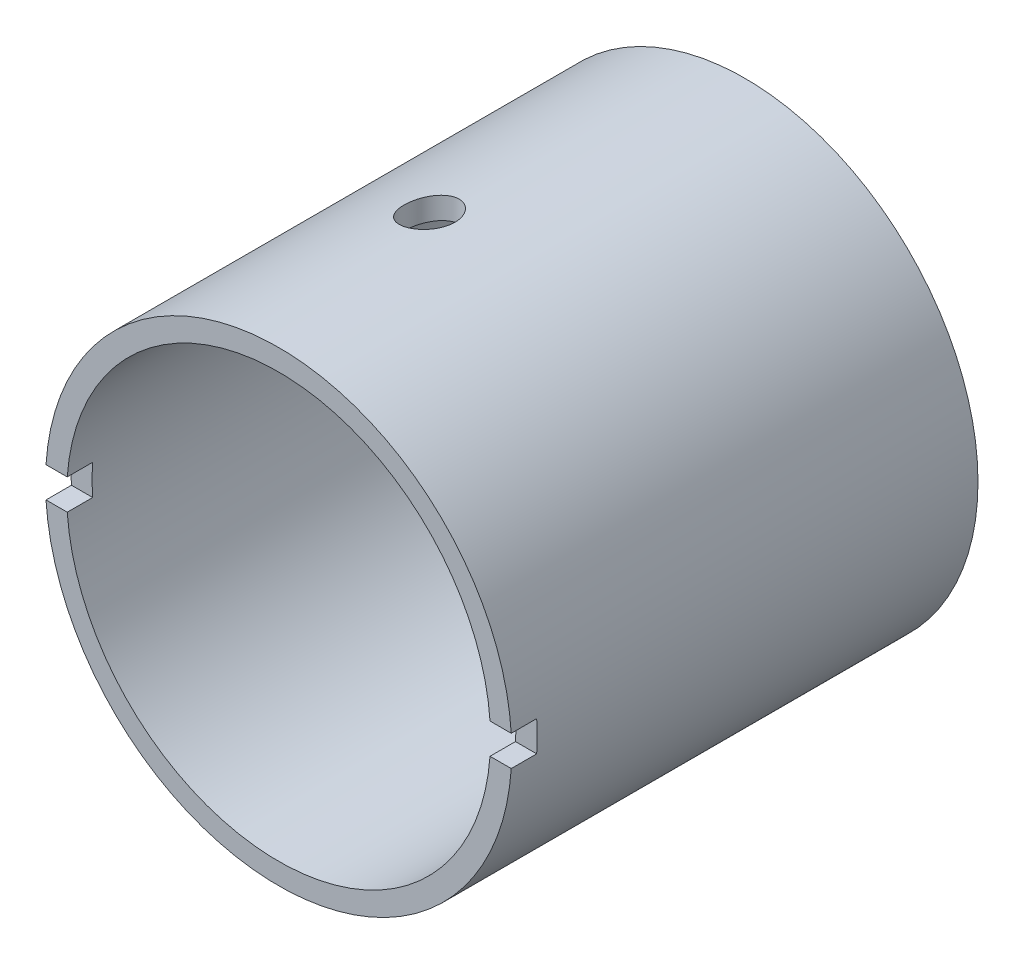
ISO-10303-21;
HEADER;
FILE_DESCRIPTION(('STEP AP214'),'2;1');
FILE_NAME('part.step','',(''),(''),'','','');
FILE_SCHEMA(('AUTOMOTIVE_DESIGN { 1 0 10303 214 1 1 1 1 }'));
ENDSEC;
DATA;
#1=APPLICATION_CONTEXT('core data for automotive mechanical design processes');
#2=APPLICATION_PROTOCOL_DEFINITION('international standard','automotive_design',2000,#1);
#3=PRODUCT_CONTEXT('',#1,'mechanical');
#4=PRODUCT('Part','Part','',(#3));
#5=PRODUCT_RELATED_PRODUCT_CATEGORY('part','',(#4));
#6=PRODUCT_DEFINITION_FORMATION('','',#4);
#7=PRODUCT_DEFINITION_CONTEXT('part definition',#1,'design');
#8=PRODUCT_DEFINITION('design','',#6,#7);
#9=PRODUCT_DEFINITION_SHAPE('','',#8);
#10=(LENGTH_UNIT() NAMED_UNIT(*) SI_UNIT(.MILLI.,.METRE.));
#11=(NAMED_UNIT(*) PLANE_ANGLE_UNIT() SI_UNIT($,.RADIAN.));
#12=(NAMED_UNIT(*) SI_UNIT($,.STERADIAN.) SOLID_ANGLE_UNIT());
#13=UNCERTAINTY_MEASURE_WITH_UNIT(LENGTH_MEASURE(1.E-05),#10,'distance_accuracy_value','');
#14=(GEOMETRIC_REPRESENTATION_CONTEXT(3) GLOBAL_UNCERTAINTY_ASSIGNED_CONTEXT((#13)) GLOBAL_UNIT_ASSIGNED_CONTEXT((#10,
#11,#12)) REPRESENTATION_CONTEXT('',''));
#15=CARTESIAN_POINT('',(0.,0.,0.));
#16=DIRECTION('',(0.,0.,1.));
#17=DIRECTION('',(1.,0.,0.));
#18=AXIS2_PLACEMENT_3D('',#15,#16,#17);
#19=CARTESIAN_POINT('',(0.,0.,55.));
#20=DIRECTION('',(0.,0.,-1.));
#21=DIRECTION('',(-1.,0.,0.));
#22=AXIS2_PLACEMENT_3D('',#19,#20,#21);
#23=CYLINDRICAL_SURFACE('',#22,25.);
#24=CARTESIAN_POINT('',(0.,0.,55.));
#25=DIRECTION('',(0.,0.,1.));
#26=DIRECTION('',(1.,0.,0.));
#27=AXIS2_PLACEMENT_3D('',#24,#25,#26);
#28=CIRCLE('',#27,25.);
#29=CARTESIAN_POINT('',(-24.9351158008139,-1.8,55.));
#30=VERTEX_POINT('',#29);
#31=CARTESIAN_POINT('',(24.9351158008139,-1.8,55.));
#32=VERTEX_POINT('',#31);
#33=EDGE_CURVE('E353',#30,#32,#28,.T.);
#34=ORIENTED_EDGE('',*,*,#33,.T.);
#35=DIRECTION('',(0.,0.,-1.));
#36=VECTOR('',#35,1.);
#37=CARTESIAN_POINT('',(24.9351158008139,-1.8,55.));
#38=LINE('',#37,#36);
#39=CARTESIAN_POINT('',(24.9351158008139,-1.8,52.));
#40=VERTEX_POINT('',#39);
#41=EDGE_CURVE('E166',#32,#40,#38,.T.);
#42=ORIENTED_EDGE('',*,*,#41,.T.);
#43=CARTESIAN_POINT('',(0.,0.,52.));
#44=DIRECTION('',(0.,0.,-1.));
#45=DIRECTION('',(-1.,0.,0.));
#46=AXIS2_PLACEMENT_3D('',#43,#44,#45);
#47=CIRCLE('',#46,25.);
#48=CARTESIAN_POINT('',(24.9351158008139,1.8,52.));
#49=VERTEX_POINT('',#48);
#50=EDGE_CURVE('E257',#49,#40,#47,.T.);
#51=ORIENTED_EDGE('',*,*,#50,.F.);
#52=DIRECTION('',(0.,0.,-1.));
#53=VECTOR('',#52,1.);
#54=CARTESIAN_POINT('',(24.9351158008139,1.8,55.));
#55=LINE('',#54,#53);
#56=CARTESIAN_POINT('',(24.9351158008139,1.8,55.));
#57=VERTEX_POINT('',#56);
#58=EDGE_CURVE('E258',#49,#57,#55,.F.);
#59=ORIENTED_EDGE('',*,*,#58,.T.);
#60=CARTESIAN_POINT('',(-24.9351158008139,1.8,55.));
#61=VERTEX_POINT('',#60);
#62=EDGE_CURVE('E193',#57,#61,#28,.T.);
#63=ORIENTED_EDGE('',*,*,#62,.T.);
#64=DIRECTION('',(0.,0.,-1.));
#65=VECTOR('',#64,1.);
#66=CARTESIAN_POINT('',(-24.9351158008139,1.8,55.));
#67=LINE('',#66,#65);
#68=CARTESIAN_POINT('',(-24.9351158008139,1.8,52.));
#69=VERTEX_POINT('',#68);
#70=EDGE_CURVE('E246',#61,#69,#67,.T.);
#71=ORIENTED_EDGE('',*,*,#70,.T.);
#72=CARTESIAN_POINT('',(-24.9351158008139,-1.8,52.));
#73=VERTEX_POINT('',#72);
#74=EDGE_CURVE('E254',#73,#69,#47,.T.);
#75=ORIENTED_EDGE('',*,*,#74,.F.);
#76=DIRECTION('',(0.,0.,-1.));
#77=VECTOR('',#76,1.);
#78=CARTESIAN_POINT('',(-24.9351158008139,-1.8,55.));
#79=LINE('',#78,#77);
#80=EDGE_CURVE('E263',#73,#30,#79,.F.);
#81=ORIENTED_EDGE('',*,*,#80,.T.);
#82=EDGE_LOOP('',(#34,#42,#51,#59,#63,#71,#75,#81));
#83=FACE_BOUND('',#82,.T.);
#84=CARTESIAN_POINT('',(0.,0.,2.));
#85=DIRECTION('',(0.,0.,1.));
#86=DIRECTION('',(1.,0.,0.));
#87=AXIS2_PLACEMENT_3D('',#84,#85,#86);
#88=CIRCLE('',#87,25.);
#89=CARTESIAN_POINT('',(24.661508469678,-4.1,2.));
#90=VERTEX_POINT('',#89);
#91=CARTESIAN_POINT('',(24.661508469678,4.1,2.));
#92=VERTEX_POINT('',#91);
#93=EDGE_CURVE('E210',#90,#92,#88,.T.);
#94=ORIENTED_EDGE('',*,*,#93,.F.);
#95=DIRECTION('',(0.,0.,-1.));
#96=VECTOR('',#95,1.);
#97=CARTESIAN_POINT('',(24.661508469678,-4.1,55.));
#98=LINE('',#97,#96);
#99=CARTESIAN_POINT('',(24.661508469678,-4.1,0.));
#100=VERTEX_POINT('',#99);
#101=EDGE_CURVE('E310',#90,#100,#98,.T.);
#102=ORIENTED_EDGE('',*,*,#101,.T.);
#103=CARTESIAN_POINT('',(0.,0.,0.));
#104=DIRECTION('',(0.,0.,1.));
#105=DIRECTION('',(1.,0.,0.));
#106=AXIS2_PLACEMENT_3D('',#103,#104,#105);
#107=CIRCLE('',#106,25.);
#108=CARTESIAN_POINT('',(-24.661508469678,-4.1,0.));
#109=VERTEX_POINT('',#108);
#110=EDGE_CURVE('E196',#109,#100,#107,.T.);
#111=ORIENTED_EDGE('',*,*,#110,.F.);
#112=DIRECTION('',(0.,0.,-1.));
#113=VECTOR('',#112,1.);
#114=CARTESIAN_POINT('',(-24.661508469678,-4.1,55.));
#115=LINE('',#114,#113);
#116=CARTESIAN_POINT('',(-24.661508469678,-4.1,2.));
#117=VERTEX_POINT('',#116);
#118=EDGE_CURVE('E191',#109,#117,#115,.F.);
#119=ORIENTED_EDGE('',*,*,#118,.T.);
#120=CARTESIAN_POINT('',(0.,0.,2.));
#121=DIRECTION('',(0.,0.,-1.));
#122=DIRECTION('',(-1.,0.,0.));
#123=AXIS2_PLACEMENT_3D('',#120,#121,#122);
#124=CIRCLE('',#123,25.);
#125=CARTESIAN_POINT('',(-24.661508469678,4.1,2.));
#126=VERTEX_POINT('',#125);
#127=EDGE_CURVE('E202',#117,#126,#124,.T.);
#128=ORIENTED_EDGE('',*,*,#127,.T.);
#129=DIRECTION('',(0.,0.,-1.));
#130=VECTOR('',#129,1.);
#131=CARTESIAN_POINT('',(-24.661508469678,4.1,55.));
#132=LINE('',#131,#130);
#133=CARTESIAN_POINT('',(-24.661508469678,4.1,0.));
#134=VERTEX_POINT('',#133);
#135=EDGE_CURVE('E206',#126,#134,#132,.T.);
#136=ORIENTED_EDGE('',*,*,#135,.T.);
#137=CARTESIAN_POINT('',(24.661508469678,4.1,0.));
#138=VERTEX_POINT('',#137);
#139=EDGE_CURVE('E351',#138,#134,#107,.T.);
#140=ORIENTED_EDGE('',*,*,#139,.F.);
#141=DIRECTION('',(0.,0.,-1.));
#142=VECTOR('',#141,1.);
#143=CARTESIAN_POINT('',(24.661508469678,4.1,55.));
#144=LINE('',#143,#142);
#145=EDGE_CURVE('E303',#138,#92,#144,.F.);
#146=ORIENTED_EDGE('',*,*,#145,.T.);
#147=EDGE_LOOP('',(#94,#102,#111,#119,#128,#136,#140,#146));
#148=FACE_BOUND('',#147,.T.);
#149=CARTESIAN_POINT('',(-5.5,24.3874967965144,28.7));
#150=CARTESIAN_POINT('',(-5.67392919300831,24.3482684801759,28.7000074579326));
#151=CARTESIAN_POINT('',(-5.84756228211651,24.3071361176576,28.7151729434584));
#152=CARTESIAN_POINT('',(-6.18919291889446,24.2224066837838,28.7750775840968));
#153=CARTESIAN_POINT('',(-6.35718231261993,24.1788062716928,28.8198577452165));
#154=CARTESIAN_POINT('',(-6.68263030274752,24.0908869838472,28.9375218932299));
#155=CARTESIAN_POINT('',(-6.84009887985654,24.0465688400403,29.0103787874892));
#156=CARTESIAN_POINT('',(-7.14037398553215,23.9591222647459,29.1822436097214));
#157=CARTESIAN_POINT('',(-7.28318378547725,23.915993569389,29.2812456852139));
#158=CARTESIAN_POINT('',(-7.55076469521287,23.8328700096322,29.5034710516955));
#159=CARTESIAN_POINT('',(-7.67545285284368,23.7928899178751,29.6267999876948));
#160=CARTESIAN_POINT('',(-7.90212505426542,23.71857255763,29.8943109306009));
#161=CARTESIAN_POINT('',(-8.00411180210585,23.6842346172121,30.0384904505383));
#162=CARTESIAN_POINT('',(-8.17892617503337,23.6244251436526,30.3389032030407));
#163=CARTESIAN_POINT('',(-8.25258051147822,23.5987056210142,30.4946049051862));
#164=CARTESIAN_POINT('',(-8.37239349223359,23.5564663057971,30.8174134178461));
#165=CARTESIAN_POINT('',(-8.41856352723394,23.5399427022146,30.9845154715098));
#166=CARTESIAN_POINT('',(-8.47976125381432,23.5179644187434,31.3155515680202));
#167=CARTESIAN_POINT('',(-8.49635059581277,23.5119550189305,31.4791610506678));
#168=CARTESIAN_POINT('',(-8.50256827317927,23.5097076211728,31.806942465166));
#169=CARTESIAN_POINT('',(-8.49220219406073,23.5134675988859,31.9711142734551));
#170=CARTESIAN_POINT('',(-8.44566577704028,23.5302209337477,32.2901335075393));
#171=CARTESIAN_POINT('',(-8.41028780943998,23.5429307151927,32.4451127141493));
#172=CARTESIAN_POINT('',(-8.31589741666424,23.5764360868882,32.74675858631));
#173=CARTESIAN_POINT('',(-8.25688317284052,23.5972322993302,32.8934246112274));
#174=CARTESIAN_POINT('',(-8.11576748527114,23.6461409035186,33.1776491854925));
#175=CARTESIAN_POINT('',(-8.03322178974395,23.6743932127665,33.3149624856899));
#176=CARTESIAN_POINT('',(-7.84811571531853,23.7363979539198,33.5739548491297));
#177=CARTESIAN_POINT('',(-7.74555061715081,23.7701516823909,33.6956302147287));
#178=CARTESIAN_POINT('',(-7.51744211531384,23.8433032003076,33.9265681648105));
#179=CARTESIAN_POINT('',(-7.39098556394569,23.8829024483257,34.0348651673057));
#180=CARTESIAN_POINT('',(-7.12243074557851,23.9643623326798,34.2288685675067));
#181=CARTESIAN_POINT('',(-6.98032867680985,24.0062235173891,34.3145694572382));
#182=CARTESIAN_POINT('',(-6.67774618273389,24.092186339021,34.4645277341487));
#183=CARTESIAN_POINT('',(-6.51674112253339,24.1363075359048,34.5277179409257));
#184=CARTESIAN_POINT('',(-6.18593332613391,24.2232009588138,34.6256201964178));
#185=CARTESIAN_POINT('',(-6.0161299904691,24.265973092601,34.6603303019364));
#186=CARTESIAN_POINT('',(-5.67117580562046,24.3489102710791,34.7001740446718));
#187=CARTESIAN_POINT('',(-5.49599605832131,24.3890552002485,34.7051011038698));
#188=CARTESIAN_POINT('',(-5.14655397521795,24.4651782783948,34.6842418922242));
#189=CARTESIAN_POINT('',(-4.97229153062168,24.5011569326276,34.6584593499095));
#190=CARTESIAN_POINT('',(-4.63381414248078,24.5673945765818,34.5773844960314));
#191=CARTESIAN_POINT('',(-4.46946274595578,24.5977615553103,34.5227506962476));
#192=CARTESIAN_POINT('',(-4.15189356246621,24.6533522941331,34.385611509737));
#193=CARTESIAN_POINT('',(-3.99867417012587,24.678576796789,34.3031101515975));
#194=CARTESIAN_POINT('',(-3.71196327422779,24.7233065852616,34.1148688214452));
#195=CARTESIAN_POINT('',(-3.57807046855974,24.7429405180595,34.0097701917157));
#196=CARTESIAN_POINT('',(-3.32966834384961,24.77759203687,33.7780992655002));
#197=CARTESIAN_POINT('',(-3.21515754504035,24.7926099753736,33.6515286098278));
#198=CARTESIAN_POINT('',(-3.01046159187833,24.8182927307089,33.3823800966834));
#199=CARTESIAN_POINT('',(-2.91996956174915,24.8290134566721,33.2400408087785));
#200=CARTESIAN_POINT('',(-2.76401794616156,24.8468588159456,32.9420467498808));
#201=CARTESIAN_POINT('',(-2.69855779222303,24.8539835309234,32.7863922813771));
#202=CARTESIAN_POINT('',(-2.59479464143845,24.8650311406215,32.4667601312107));
#203=CARTESIAN_POINT('',(-2.55640040851333,24.8689647988506,32.3028124279152));
#204=CARTESIAN_POINT('',(-2.50753485883738,24.873939817281,31.9707638365275));
#205=CARTESIAN_POINT('',(-2.4970635543889,24.874981176208,31.8026629466056));
#206=CARTESIAN_POINT('',(-2.50435040770818,24.8742485502895,31.4670851977939));
#207=CARTESIAN_POINT('',(-2.5221077694742,24.8724746448299,31.2996083214414));
#208=CARTESIAN_POINT('',(-2.58533105051007,24.8659819932281,30.9700276930328));
#209=CARTESIAN_POINT('',(-2.63079694654558,24.8612632495553,30.8079239364712));
#210=CARTESIAN_POINT('',(-2.74810122278733,24.8485693239291,30.4936923499842));
#211=CARTESIAN_POINT('',(-2.81993965983047,24.8405941349575,30.3415645415593));
#212=CARTESIAN_POINT('',(-2.98785659979526,24.8209554045003,30.0516065110925));
#213=CARTESIAN_POINT('',(-3.08393389399518,24.8092920469256,29.9137755765904));
#214=CARTESIAN_POINT('',(-3.29745486460702,24.7818147920403,29.6562857553877));
#215=CARTESIAN_POINT('',(-3.41489785323723,24.7660010283279,29.5366262839581));
#216=CARTESIAN_POINT('',(-3.66765830350659,24.7298311020367,29.3187468078179));
#217=CARTESIAN_POINT('',(-3.80297960499109,24.7094739629973,29.2205314208518));
#218=CARTESIAN_POINT('',(-4.08799399359584,24.6639251086554,29.047806530026));
#219=CARTESIAN_POINT('',(-4.23774321575919,24.6387140948417,28.9733949208575));
#220=CARTESIAN_POINT('',(-4.54662812951893,24.5835859352755,28.8506755836889));
#221=CARTESIAN_POINT('',(-4.70575414240534,24.5536735908298,28.8023414444945));
#222=CARTESIAN_POINT('',(-4.97147508002685,24.5009344822202,28.74499429797));
#223=CARTESIAN_POINT('',(-5.07669129722067,24.4793558084475,28.7281158135943));
#224=CARTESIAN_POINT('',(-5.28797497612968,24.4345858957583,28.7056164203835));
#225=CARTESIAN_POINT('',(-5.39404243368979,24.4113946647088,28.6999954566317));
#226=CARTESIAN_POINT('',(-5.5,24.3874967965144,28.7));
#227=B_SPLINE_CURVE_WITH_KNOTS('',3,(#149,#150,#151,#152,#153,#154,#155,#156,#157,#158,#159,
#160,#161,#162,#163,#164,#165,#166,#167,#168,#169,#170,#171,#172,#173,#174,#175,#176,#177,#178,
#179,#180,#181,#182,#183,#184,#185,#186,#187,#188,#189,#190,#191,#192,#193,#194,#195,#196,#197,
#198,#199,#200,#201,#202,#203,#204,#205,#206,#207,#208,#209,#210,#211,#212,#213,#214,#215,#216,
#217,#218,#219,#220,#221,#222,#223,#224,#225,#226),.UNSPECIFIED.,.T.,.F.,(4,2,2,2,2,2,2,2,2,2,2,
2,2,2,2,2,2,2,2,2,2,2,2,2,2,2,2,2,2,2,2,2,2,2,2,2,2,2,4),(0.,0.534491629593441,1.06972489775104,
1.60444298076928,2.13904147087002,2.67601482649572,3.21292418695667,3.73269859925424,
4.25225744418254,4.74346989840965,5.23458057514686,5.71079231112054,6.18704069534082,
6.67295463857791,7.15898326727633,7.67011266236879,8.1813665341931,8.71436710052127,
9.24740403043684,9.78413395120088,10.3207987128978,10.8457125784825,11.3705505939714,
11.8820987774683,12.3936078879219,12.8982273008628,13.4028352530913,13.9057339899156,
14.4086329483082,14.911517726033,15.4144020820759,15.9172875219182,16.4201478892728,
16.9229920719447,17.4259444299434,17.9309393874662,18.4354219226858,18.7610355104788,
19.0866475098526),.UNSPECIFIED.);
#228=CARTESIAN_POINT('',(-5.5,24.3874967965144,28.7));
#229=VERTEX_POINT('',#228);
#230=EDGE_CURVE('E416',#229,#229,#227,.T.);
#231=ORIENTED_EDGE('',*,*,#230,.T.);
#232=EDGE_LOOP('',(#231));
#233=FACE_BOUND('',#232,.T.);
#234=ADVANCED_FACE('F43',(#83,#148,#233),#23,.F.);
#235=CARTESIAN_POINT('',(0.,0.,55.));
#236=DIRECTION('',(0.,0.,-1.));
#237=DIRECTION('',(-1.,0.,0.));
#238=AXIS2_PLACEMENT_3D('',#235,#236,#237);
#239=CYLINDRICAL_SURFACE('',#238,27.5);
#240=CARTESIAN_POINT('',(0.,0.,0.));
#241=DIRECTION('',(0.,0.,1.));
#242=DIRECTION('',(1.,0.,0.));
#243=AXIS2_PLACEMENT_3D('',#240,#241,#242);
#244=CIRCLE('',#243,27.5);
#245=CARTESIAN_POINT('',(27.5,0.,0.));
#246=VERTEX_POINT('',#245);
#247=EDGE_CURVE('E186',#246,#246,#244,.T.);
#248=ORIENTED_EDGE('',*,*,#247,.T.);
#249=EDGE_LOOP('',(#248));
#250=FACE_BOUND('',#249,.T.);
#251=DIRECTION('',(0.,0.,-1.));
#252=VECTOR('',#251,1.);
#253=CARTESIAN_POINT('',(27.4410276775488,-1.8,55.));
#254=LINE('',#253,#252);
#255=CARTESIAN_POINT('',(27.4410276775488,-1.8,55.));
#256=VERTEX_POINT('',#255);
#257=CARTESIAN_POINT('',(27.4410276775488,-1.8,52.));
#258=VERTEX_POINT('',#257);
#259=EDGE_CURVE('E11',#256,#258,#254,.T.);
#260=ORIENTED_EDGE('',*,*,#259,.F.);
#261=CARTESIAN_POINT('',(0.,0.,55.));
#262=DIRECTION('',(0.,0.,1.));
#263=DIRECTION('',(1.,0.,0.));
#264=AXIS2_PLACEMENT_3D('',#261,#262,#263);
#265=CIRCLE('',#264,27.5);
#266=CARTESIAN_POINT('',(-27.4410276775488,-1.8,55.));
#267=VERTEX_POINT('',#266);
#268=EDGE_CURVE('E179',#267,#256,#265,.T.);
#269=ORIENTED_EDGE('',*,*,#268,.F.);
#270=DIRECTION('',(0.,0.,-1.));
#271=VECTOR('',#270,1.);
#272=CARTESIAN_POINT('',(-27.4410276775488,-1.8,55.));
#273=LINE('',#272,#271);
#274=CARTESIAN_POINT('',(-27.4410276775488,-1.8,52.));
#275=VERTEX_POINT('',#274);
#276=EDGE_CURVE('E221',#275,#267,#273,.F.);
#277=ORIENTED_EDGE('',*,*,#276,.F.);
#278=CARTESIAN_POINT('',(0.,0.,52.));
#279=DIRECTION('',(0.,0.,-1.));
#280=DIRECTION('',(-1.,0.,0.));
#281=AXIS2_PLACEMENT_3D('',#278,#279,#280);
#282=CIRCLE('',#281,27.5);
#283=CARTESIAN_POINT('',(-27.4410276775488,1.8,52.));
#284=VERTEX_POINT('',#283);
#285=EDGE_CURVE('E214',#275,#284,#282,.T.);
#286=ORIENTED_EDGE('',*,*,#285,.T.);
#287=DIRECTION('',(0.,0.,-1.));
#288=VECTOR('',#287,1.);
#289=CARTESIAN_POINT('',(-27.4410276775488,1.8,55.));
#290=LINE('',#289,#288);
#291=CARTESIAN_POINT('',(-27.4410276775488,1.8,55.));
#292=VERTEX_POINT('',#291);
#293=EDGE_CURVE('E218',#292,#284,#290,.T.);
#294=ORIENTED_EDGE('',*,*,#293,.F.);
#295=CARTESIAN_POINT('',(27.4410276775488,1.8,55.));
#296=VERTEX_POINT('',#295);
#297=EDGE_CURVE('E185',#296,#292,#265,.T.);
#298=ORIENTED_EDGE('',*,*,#297,.F.);
#299=DIRECTION('',(0.,0.,-1.));
#300=VECTOR('',#299,1.);
#301=CARTESIAN_POINT('',(27.4410276775488,1.8,55.));
#302=LINE('',#301,#300);
#303=CARTESIAN_POINT('',(27.4410276775488,1.8,52.));
#304=VERTEX_POINT('',#303);
#305=EDGE_CURVE('E58',#304,#296,#302,.F.);
#306=ORIENTED_EDGE('',*,*,#305,.F.);
#307=EDGE_CURVE('E181',#304,#258,#282,.T.);
#308=ORIENTED_EDGE('',*,*,#307,.T.);
#309=EDGE_LOOP('',(#260,#269,#277,#286,#294,#298,#306,#308));
#310=FACE_BOUND('',#309,.T.);
#311=CARTESIAN_POINT('',(-5.5,26.944387170615,28.7));
#312=CARTESIAN_POINT('',(-5.67295325061547,26.9090807066622,28.7000074603733));
#313=CARTESIAN_POINT('',(-5.84568969430511,26.872070109542,28.7150037489024));
#314=CARTESIAN_POINT('',(-6.18571380405917,26.7958470302844,28.7743104207479));
#315=CARTESIAN_POINT('',(-6.35299378253059,26.7566316370385,28.8186604345446));
#316=CARTESIAN_POINT('',(-6.67721411120855,26.6775679196759,28.9352563256079));
#317=CARTESIAN_POINT('',(-6.83416329358059,26.6377201733313,29.0074780020541));
#318=CARTESIAN_POINT('',(-7.13354307423433,26.5591141197814,29.1778581627756));
#319=CARTESIAN_POINT('',(-7.27597703270815,26.5203555619468,29.2760106252341));
#320=CARTESIAN_POINT('',(-7.5428227223899,26.4457012503292,29.4961638851865));
#321=CARTESIAN_POINT('',(-7.66716989307181,26.4098159479676,29.6182466302717));
#322=CARTESIAN_POINT('',(-7.89342145923758,26.3430796766916,29.8829065505472));
#323=CARTESIAN_POINT('',(-7.99532781997634,26.3122282669953,30.0254819292854));
#324=CARTESIAN_POINT('',(-8.17090164050383,26.2582294922238,30.3232733983357));
#325=CARTESIAN_POINT('',(-8.24523636222044,26.2349021619268,30.4780627522249));
#326=CARTESIAN_POINT('',(-8.36661729649397,26.1964464577906,30.7989444241791));
#327=CARTESIAN_POINT('',(-8.41367239234482,26.1813154150307,30.965033043062));
#328=CARTESIAN_POINT('',(-8.47720498814822,26.1608116255797,31.295834989655));
#329=CARTESIAN_POINT('',(-8.49495066315681,26.1550343898537,31.4602802890335));
#330=CARTESIAN_POINT('',(-8.50317879541043,26.1523608333712,31.7899098233326));
#331=CARTESIAN_POINT('',(-8.49366606896628,26.1554629437153,31.9550939225648));
#332=CARTESIAN_POINT('',(-8.44833992546805,26.1701372384316,32.2771209222928));
#333=CARTESIAN_POINT('',(-8.41319829367208,26.1814930512776,32.4340691222229));
#334=CARTESIAN_POINT('',(-8.31862264321668,26.2116951336794,32.7396920646774));
#335=CARTESIAN_POINT('',(-8.25918715011693,26.2305418578707,32.8883663044173));
#336=CARTESIAN_POINT('',(-8.11683270822502,26.2749433234495,33.17591916357));
#337=CARTESIAN_POINT('',(-8.03355382205093,26.3006004035949,33.3146033850636));
#338=CARTESIAN_POINT('',(-7.84645756612344,26.3570223904071,33.5761685720818));
#339=CARTESIAN_POINT('',(-7.74263610411134,26.3877883146032,33.6990463807714));
#340=CARTESIAN_POINT('',(-7.51253695167765,26.4542377329499,33.9310301542181));
#341=CARTESIAN_POINT('',(-7.3854962202371,26.4900740064076,34.0393356319081));
#342=CARTESIAN_POINT('',(-7.11565633449622,26.5638285322562,34.2332335870538));
#343=CARTESIAN_POINT('',(-6.97285399159768,26.6017472051373,34.3188214567347));
#344=CARTESIAN_POINT('',(-6.66994223557336,26.6793389085449,34.4677972589935));
#345=CARTESIAN_POINT('',(-6.50940194201774,26.7190268831054,34.5303030946924));
#346=CARTESIAN_POINT('',(-6.17972381644298,26.7971957740108,34.6270273780724));
#347=CARTESIAN_POINT('',(-6.01058550636552,26.8356766230455,34.661244251029));
#348=CARTESIAN_POINT('',(-5.66737393236093,26.9102559131203,34.700330366265));
#349=CARTESIAN_POINT('',(-5.49327774336578,26.9463392491677,34.7050283197744));
#350=CARTESIAN_POINT('',(-5.1461677735918,27.0147782252966,34.6841285880804));
#351=CARTESIAN_POINT('',(-4.97315388925878,27.0471342273299,34.6585338472489));
#352=CARTESIAN_POINT('',(-4.63651108247551,27.1068531401033,34.5781585584055));
#353=CARTESIAN_POINT('',(-4.47276962488583,27.1342950356037,34.5239084457289));
#354=CARTESIAN_POINT('',(-4.15641402255829,27.1845524262626,34.3878271996858));
#355=CARTESIAN_POINT('',(-4.00379857202593,27.2073684648925,34.3059993093211));
#356=CARTESIAN_POINT('',(-3.7175016247042,27.2479483619705,34.1189524633787));
#357=CARTESIAN_POINT('',(-3.58349203222821,27.265807531478,34.014256076541));
#358=CARTESIAN_POINT('',(-3.33481808369157,27.2973392359443,33.7834487442591));
#359=CARTESIAN_POINT('',(-3.22015251003647,27.3110120344553,33.6573391476563));
#360=CARTESIAN_POINT('',(-3.01482424518273,27.3344366816728,33.3888310315269));
#361=CARTESIAN_POINT('',(-2.923908012664,27.3442305769027,33.2466299584506));
#362=CARTESIAN_POINT('',(-2.76711668162464,27.3605428707969,32.9488630577119));
#363=CARTESIAN_POINT('',(-2.70124110686781,27.3670613317559,32.7932974842916));
#364=CARTESIAN_POINT('',(-2.59662499990788,27.3771859881474,32.4736972348752));
#365=CARTESIAN_POINT('',(-2.55780811304458,27.380800382764,32.3096878038209));
#366=CARTESIAN_POINT('',(-2.50813894972682,27.3853952163377,31.9774512710533));
#367=CARTESIAN_POINT('',(-2.49728669068487,27.3863756536547,31.8092241667139));
#368=CARTESIAN_POINT('',(-2.50386281362596,27.3857751497929,31.4733333776553));
#369=CARTESIAN_POINT('',(-2.52129035223946,27.3841942849982,31.3056696762836));
#370=CARTESIAN_POINT('',(-2.58391735427279,27.3783554575894,30.9756597660282));
#371=CARTESIAN_POINT('',(-2.62911680915952,27.374097495798,30.8133135555107));
#372=CARTESIAN_POINT('',(-2.74596763867846,27.3626220549596,30.4985473133388));
#373=CARTESIAN_POINT('',(-2.81761920425645,27.3554045545489,30.3461273533467));
#374=CARTESIAN_POINT('',(-2.98526312691049,27.3376165423286,30.0555451234407));
#375=CARTESIAN_POINT('',(-3.08125431816962,27.3270461911074,29.9173821710918));
#376=CARTESIAN_POINT('',(-3.29472941512195,27.3021294519139,29.6592065817114));
#377=CARTESIAN_POINT('',(-3.41221226602752,27.2877832492411,29.5391930544534));
#378=CARTESIAN_POINT('',(-3.66521278277116,27.2549527901987,29.3206080785225));
#379=CARTESIAN_POINT('',(-3.80073440969863,27.2364676243547,29.2220413518593));
#380=CARTESIAN_POINT('',(-4.08624619461273,27.1950998442558,29.0487179004802));
#381=CARTESIAN_POINT('',(-4.23628419772667,27.1722024233797,28.97404366459));
#382=CARTESIAN_POINT('',(-4.54593572804234,27.1221123192496,28.8508821993931));
#383=CARTESIAN_POINT('',(-4.70553908925373,27.0949241476706,28.8023676974704));
#384=CARTESIAN_POINT('',(-4.97170938707608,27.0470582423256,28.7449567436065));
#385=CARTESIAN_POINT('',(-5.0768369334503,27.027528185018,28.7280971658544));
#386=CARTESIAN_POINT('',(-5.28800344653248,26.9870076724517,28.7056165304921));
#387=CARTESIAN_POINT('',(-5.39404240972052,26.9660172228309,28.699995429498));
#388=CARTESIAN_POINT('',(-5.5,26.944387170615,28.7));
#389=B_SPLINE_CURVE_WITH_KNOTS('',3,(#311,#312,#313,#314,#315,#316,#317,#318,#319,#320,#321,
#322,#323,#324,#325,#326,#327,#328,#329,#330,#331,#332,#333,#334,#335,#336,#337,#338,#339,#340,
#341,#342,#343,#344,#345,#346,#347,#348,#349,#350,#351,#352,#353,#354,#355,#356,#357,#358,#359,
#360,#361,#362,#363,#364,#365,#366,#367,#368,#369,#370,#371,#372,#373,#374,#375,#376,#377,#378,
#379,#380,#381,#382,#383,#384,#385,#386,#387,#388),.UNSPECIFIED.,.T.,.F.,(4,2,2,2,2,2,2,2,2,2,2,
2,2,2,2,2,2,2,2,2,2,2,2,2,2,2,2,2,2,2,2,2,2,2,2,2,2,2,4),(0.,0.52916068132319,1.05903724406258,
1.58845474915982,2.1177494173663,2.64888932247996,3.17998269447924,3.69722272619751,
4.21429422994914,4.70834325865234,5.20230499878297,5.68376418063111,6.16525258748579,
6.65443181583361,7.14370859120179,7.65364276641457,8.16368029183252,8.6915737248397,
9.21949654142155,9.75047991630262,10.281411685207,10.8028431517479,11.3242133220708,
11.8347266855002,12.3452079030576,12.8499933346819,13.3547691655551,13.8581147817537,
14.3614607113662,14.8647916303046,15.3681223945913,15.8714567922652,16.3747670858318,
16.8780526840925,17.3814489804524,17.8865649541913,18.3911533002293,18.7153380548224,
19.0395215579606),.UNSPECIFIED.);
#390=CARTESIAN_POINT('',(-5.5,26.944387170615,28.7));
#391=VERTEX_POINT('',#390);
#392=EDGE_CURVE('E48',#391,#391,#389,.T.);
#393=ORIENTED_EDGE('',*,*,#392,.F.);
#394=EDGE_LOOP('',(#393));
#395=FACE_BOUND('',#394,.T.);
#396=ADVANCED_FACE('F45',(#250,#310,#395),#239,.T.);
#397=CARTESIAN_POINT('',(0.,0.,55.));
#398=DIRECTION('',(0.,0.,1.));
#399=DIRECTION('',(1.,0.,0.));
#400=AXIS2_PLACEMENT_3D('',#397,#398,#399);
#401=PLANE('',#400);
#402=ORIENTED_EDGE('',*,*,#268,.T.);
#403=DIRECTION('',(-1.,0.,0.));
#404=VECTOR('',#403,1.);
#405=CARTESIAN_POINT('',(0.,-1.8,55.));
#406=LINE('',#405,#404);
#407=EDGE_CURVE('E161',#256,#32,#406,.T.);
#408=ORIENTED_EDGE('',*,*,#407,.T.);
#409=ORIENTED_EDGE('',*,*,#33,.F.);
#410=EDGE_CURVE('E173',#30,#267,#406,.T.);
#411=ORIENTED_EDGE('',*,*,#410,.T.);
#412=EDGE_LOOP('',(#402,#408,#409,#411));
#413=FACE_BOUND('',#412,.T.);
#414=ADVANCED_FACE('F183',(#413),#401,.T.);
#415=ORIENTED_EDGE('',*,*,#297,.T.);
#416=DIRECTION('',(1.,0.,0.));
#417=VECTOR('',#416,1.);
#418=CARTESIAN_POINT('',(0.,1.8,55.));
#419=LINE('',#418,#417);
#420=EDGE_CURVE('E240',#292,#61,#419,.T.);
#421=ORIENTED_EDGE('',*,*,#420,.T.);
#422=ORIENTED_EDGE('',*,*,#62,.F.);
#423=EDGE_CURVE('E172',#57,#296,#419,.T.);
#424=ORIENTED_EDGE('',*,*,#423,.T.);
#425=EDGE_LOOP('',(#415,#421,#422,#424));
#426=FACE_BOUND('',#425,.T.);
#427=ADVANCED_FACE('F236',(#426),#401,.T.);
#428=CARTESIAN_POINT('',(0.,0.,0.));
#429=DIRECTION('',(0.,0.,1.));
#430=DIRECTION('',(1.,0.,0.));
#431=AXIS2_PLACEMENT_3D('',#428,#429,#430);
#432=PLANE('',#431);
#433=ORIENTED_EDGE('',*,*,#110,.T.);
#434=DIRECTION('',(1.,0.,0.));
#435=VECTOR('',#434,1.);
#436=CARTESIAN_POINT('',(26.1240796233199,-4.1,0.));
#437=LINE('',#436,#435);
#438=CARTESIAN_POINT('',(20.,-4.1,0.));
#439=VERTEX_POINT('',#438);
#440=EDGE_CURVE('E281',#439,#100,#437,.T.);
#441=ORIENTED_EDGE('',*,*,#440,.F.);
#442=CARTESIAN_POINT('',(20.,0.,0.));
#443=DIRECTION('',(0.,0.,1.));
#444=DIRECTION('',(1.,0.,0.));
#445=AXIS2_PLACEMENT_3D('',#442,#443,#444);
#446=CIRCLE('',#445,4.1);
#447=CARTESIAN_POINT('',(20.,4.1,0.));
#448=VERTEX_POINT('',#447);
#449=EDGE_CURVE('E285',#448,#439,#446,.T.);
#450=ORIENTED_EDGE('',*,*,#449,.F.);
#451=DIRECTION('',(-1.,0.,0.));
#452=VECTOR('',#451,1.);
#453=CARTESIAN_POINT('',(20.,4.1,0.));
#454=LINE('',#453,#452);
#455=EDGE_CURVE('E278',#138,#448,#454,.T.);
#456=ORIENTED_EDGE('',*,*,#455,.F.);
#457=ORIENTED_EDGE('',*,*,#139,.T.);
#458=DIRECTION('',(-1.,0.,0.));
#459=VECTOR('',#458,1.);
#460=CARTESIAN_POINT('',(-20.,4.1,0.));
#461=LINE('',#460,#459);
#462=CARTESIAN_POINT('',(-20.,4.1,0.));
#463=VERTEX_POINT('',#462);
#464=EDGE_CURVE('E339',#463,#134,#461,.T.);
#465=ORIENTED_EDGE('',*,*,#464,.F.);
#466=CARTESIAN_POINT('',(-20.,0.,0.));
#467=DIRECTION('',(0.,0.,1.));
#468=DIRECTION('',(-1.,0.,0.));
#469=AXIS2_PLACEMENT_3D('',#466,#467,#468);
#470=CIRCLE('',#469,4.1);
#471=CARTESIAN_POINT('',(-20.,-4.1,0.));
#472=VERTEX_POINT('',#471);
#473=EDGE_CURVE('E319',#472,#463,#470,.T.);
#474=ORIENTED_EDGE('',*,*,#473,.F.);
#475=DIRECTION('',(1.,0.,0.));
#476=VECTOR('',#475,1.);
#477=CARTESIAN_POINT('',(-26.1240796233199,-4.1,0.));
#478=LINE('',#477,#476);
#479=EDGE_CURVE('E328',#109,#472,#478,.T.);
#480=ORIENTED_EDGE('',*,*,#479,.F.);
#481=EDGE_LOOP('',(#433,#441,#450,#456,#457,#465,#474,#480));
#482=FACE_BOUND('',#481,.T.);
#483=ORIENTED_EDGE('',*,*,#247,.F.);
#484=EDGE_LOOP('',(#483));
#485=FACE_BOUND('',#484,.T.);
#486=CARTESIAN_POINT('',(-20.,0.,0.));
#487=DIRECTION('',(0.,0.,1.));
#488=DIRECTION('',(1.,0.,0.));
#489=AXIS2_PLACEMENT_3D('',#486,#487,#488);
#490=CIRCLE('',#489,1.6);
#491=CARTESIAN_POINT('',(-18.4,0.,0.));
#492=VERTEX_POINT('',#491);
#493=EDGE_CURVE('E314',#492,#492,#490,.T.);
#494=ORIENTED_EDGE('',*,*,#493,.T.);
#495=EDGE_LOOP('',(#494));
#496=FACE_BOUND('',#495,.T.);
#497=CARTESIAN_POINT('',(20.,0.,0.));
#498=DIRECTION('',(0.,0.,1.));
#499=DIRECTION('',(-1.,0.,0.));
#500=AXIS2_PLACEMENT_3D('',#497,#498,#499);
#501=CIRCLE('',#500,1.6);
#502=CARTESIAN_POINT('',(18.4,0.,0.));
#503=VERTEX_POINT('',#502);
#504=EDGE_CURVE('E299',#503,#503,#501,.T.);
#505=ORIENTED_EDGE('',*,*,#504,.T.);
#506=EDGE_LOOP('',(#505));
#507=FACE_BOUND('',#506,.T.);
#508=ADVANCED_FACE('F364',(#482,#485,#496,#507),#432,.F.);
#509=CARTESIAN_POINT('',(-20.,0.,2.));
#510=DIRECTION('',(0.,0.,-1.));
#511=DIRECTION('',(-1.,0.,0.));
#512=AXIS2_PLACEMENT_3D('',#509,#510,#511);
#513=PLANE('',#512);
#514=CARTESIAN_POINT('',(-20.,0.,2.));
#515=DIRECTION('',(0.,0.,1.));
#516=DIRECTION('',(1.,0.,0.));
#517=AXIS2_PLACEMENT_3D('',#514,#515,#516);
#518=CIRCLE('',#517,1.6);
#519=CARTESIAN_POINT('',(-18.4,0.,2.));
#520=VERTEX_POINT('',#519);
#521=EDGE_CURVE('E315',#520,#520,#518,.T.);
#522=ORIENTED_EDGE('',*,*,#521,.F.);
#523=EDGE_LOOP('',(#522));
#524=FACE_BOUND('',#523,.T.);
#525=ORIENTED_EDGE('',*,*,#127,.F.);
#526=DIRECTION('',(1.,0.,0.));
#527=VECTOR('',#526,1.);
#528=CARTESIAN_POINT('',(-26.1240796233199,-4.1,2.));
#529=LINE('',#528,#527);
#530=CARTESIAN_POINT('',(-20.,-4.1,2.));
#531=VERTEX_POINT('',#530);
#532=EDGE_CURVE('E332',#117,#531,#529,.T.);
#533=ORIENTED_EDGE('',*,*,#532,.T.);
#534=CARTESIAN_POINT('',(-20.,0.,2.));
#535=DIRECTION('',(0.,0.,1.));
#536=DIRECTION('',(-1.,0.,0.));
#537=AXIS2_PLACEMENT_3D('',#534,#535,#536);
#538=CIRCLE('',#537,4.1);
#539=CARTESIAN_POINT('',(-20.,4.1,2.));
#540=VERTEX_POINT('',#539);
#541=EDGE_CURVE('E323',#531,#540,#538,.T.);
#542=ORIENTED_EDGE('',*,*,#541,.T.);
#543=DIRECTION('',(-1.,0.,0.));
#544=VECTOR('',#543,1.);
#545=CARTESIAN_POINT('',(-20.,4.1,2.));
#546=LINE('',#545,#544);
#547=EDGE_CURVE('E327',#540,#126,#546,.T.);
#548=ORIENTED_EDGE('',*,*,#547,.T.);
#549=EDGE_LOOP('',(#525,#533,#542,#548));
#550=FACE_BOUND('',#549,.T.);
#551=ADVANCED_FACE('F376',(#524,#550),#513,.F.);
#552=CARTESIAN_POINT('',(-20.,0.,2.));
#553=DIRECTION('',(0.,0.,-1.));
#554=DIRECTION('',(-1.,0.,0.));
#555=AXIS2_PLACEMENT_3D('',#552,#553,#554);
#556=CYLINDRICAL_SURFACE('',#555,4.1);
#557=ORIENTED_EDGE('',*,*,#473,.T.);
#558=DIRECTION('',(0.,0.,-1.));
#559=VECTOR('',#558,1.);
#560=CARTESIAN_POINT('',(-20.,4.1,2.));
#561=LINE('',#560,#559);
#562=EDGE_CURVE('E348',#540,#463,#561,.T.);
#563=ORIENTED_EDGE('',*,*,#562,.F.);
#564=ORIENTED_EDGE('',*,*,#541,.F.);
#565=DIRECTION('',(0.,0.,-1.));
#566=VECTOR('',#565,1.);
#567=CARTESIAN_POINT('',(-20.,-4.1,2.));
#568=LINE('',#567,#566);
#569=EDGE_CURVE('E335',#531,#472,#568,.T.);
#570=ORIENTED_EDGE('',*,*,#569,.T.);
#571=EDGE_LOOP('',(#557,#563,#564,#570));
#572=FACE_BOUND('',#571,.T.);
#573=ADVANCED_FACE('F380',(#572),#556,.T.);
#574=CARTESIAN_POINT('',(-20.,4.1,2.));
#575=DIRECTION('',(0.,-1.,0.));
#576=DIRECTION('',(0.,0.,-1.));
#577=AXIS2_PLACEMENT_3D('',#574,#575,#576);
#578=PLANE('',#577);
#579=ORIENTED_EDGE('',*,*,#135,.F.);
#580=ORIENTED_EDGE('',*,*,#547,.F.);
#581=ORIENTED_EDGE('',*,*,#562,.T.);
#582=ORIENTED_EDGE('',*,*,#464,.T.);
#583=EDGE_LOOP('',(#579,#580,#581,#582));
#584=FACE_BOUND('',#583,.T.);
#585=ADVANCED_FACE('F370',(#584),#578,.F.);
#586=CARTESIAN_POINT('',(-26.1240796233199,-4.1,2.));
#587=DIRECTION('',(0.,1.,0.));
#588=DIRECTION('',(0.,0.,1.));
#589=AXIS2_PLACEMENT_3D('',#586,#587,#588);
#590=PLANE('',#589);
#591=ORIENTED_EDGE('',*,*,#118,.F.);
#592=ORIENTED_EDGE('',*,*,#479,.T.);
#593=ORIENTED_EDGE('',*,*,#569,.F.);
#594=ORIENTED_EDGE('',*,*,#532,.F.);
#595=EDGE_LOOP('',(#591,#592,#593,#594));
#596=FACE_BOUND('',#595,.T.);
#597=ADVANCED_FACE('F445',(#596),#590,.F.);
#598=CARTESIAN_POINT('',(-20.,0.,2.));
#599=DIRECTION('',(0.,0.,-1.));
#600=DIRECTION('',(-1.,0.,0.));
#601=AXIS2_PLACEMENT_3D('',#598,#599,#600);
#602=CYLINDRICAL_SURFACE('',#601,1.6);
#603=ORIENTED_EDGE('',*,*,#521,.T.);
#604=EDGE_LOOP('',(#603));
#605=FACE_BOUND('',#604,.T.);
#606=ORIENTED_EDGE('',*,*,#493,.F.);
#607=EDGE_LOOP('',(#606));
#608=FACE_BOUND('',#607,.T.);
#609=ADVANCED_FACE('F440',(#605,#608),#602,.F.);
#610=CARTESIAN_POINT('',(20.,0.,2.));
#611=DIRECTION('',(0.,0.,1.));
#612=DIRECTION('',(1.,0.,0.));
#613=AXIS2_PLACEMENT_3D('',#610,#611,#612);
#614=PLANE('',#613);
#615=CARTESIAN_POINT('',(20.,0.,2.));
#616=DIRECTION('',(0.,0.,1.));
#617=DIRECTION('',(-1.,0.,0.));
#618=AXIS2_PLACEMENT_3D('',#615,#616,#617);
#619=CIRCLE('',#618,1.6);
#620=CARTESIAN_POINT('',(18.4,0.,2.));
#621=VERTEX_POINT('',#620);
#622=EDGE_CURVE('E289',#621,#621,#619,.T.);
#623=ORIENTED_EDGE('',*,*,#622,.F.);
#624=EDGE_LOOP('',(#623));
#625=FACE_BOUND('',#624,.T.);
#626=DIRECTION('',(1.,0.,0.));
#627=VECTOR('',#626,1.);
#628=CARTESIAN_POINT('',(26.1240796233199,-4.1,2.));
#629=LINE('',#628,#627);
#630=CARTESIAN_POINT('',(20.,-4.1,2.));
#631=VERTEX_POINT('',#630);
#632=EDGE_CURVE('E292',#631,#90,#629,.T.);
#633=ORIENTED_EDGE('',*,*,#632,.T.);
#634=ORIENTED_EDGE('',*,*,#93,.T.);
#635=DIRECTION('',(-1.,0.,0.));
#636=VECTOR('',#635,1.);
#637=CARTESIAN_POINT('',(20.,4.1,2.));
#638=LINE('',#637,#636);
#639=CARTESIAN_POINT('',(20.,4.1,2.));
#640=VERTEX_POINT('',#639);
#641=EDGE_CURVE('E277',#92,#640,#638,.T.);
#642=ORIENTED_EDGE('',*,*,#641,.T.);
#643=CARTESIAN_POINT('',(20.,0.,2.));
#644=DIRECTION('',(0.,0.,1.));
#645=DIRECTION('',(1.,0.,0.));
#646=AXIS2_PLACEMENT_3D('',#643,#644,#645);
#647=CIRCLE('',#646,4.1);
#648=EDGE_CURVE('E282',#640,#631,#647,.T.);
#649=ORIENTED_EDGE('',*,*,#648,.T.);
#650=EDGE_LOOP('',(#633,#634,#642,#649));
#651=FACE_BOUND('',#650,.T.);
#652=ADVANCED_FACE('F385',(#625,#651),#614,.T.);
#653=CARTESIAN_POINT('',(20.,0.,2.));
#654=DIRECTION('',(0.,0.,-1.));
#655=DIRECTION('',(-1.,0.,0.));
#656=AXIS2_PLACEMENT_3D('',#653,#654,#655);
#657=CYLINDRICAL_SURFACE('',#656,4.1);
#658=ORIENTED_EDGE('',*,*,#449,.T.);
#659=DIRECTION('',(0.,0.,-1.));
#660=VECTOR('',#659,1.);
#661=CARTESIAN_POINT('',(20.,-4.1,2.));
#662=LINE('',#661,#660);
#663=EDGE_CURVE('E269',#631,#439,#662,.T.);
#664=ORIENTED_EDGE('',*,*,#663,.F.);
#665=ORIENTED_EDGE('',*,*,#648,.F.);
#666=DIRECTION('',(0.,0.,-1.));
#667=VECTOR('',#666,1.);
#668=CARTESIAN_POINT('',(20.,4.1,2.));
#669=LINE('',#668,#667);
#670=EDGE_CURVE('E273',#640,#448,#669,.T.);
#671=ORIENTED_EDGE('',*,*,#670,.T.);
#672=EDGE_LOOP('',(#658,#664,#665,#671));
#673=FACE_BOUND('',#672,.T.);
#674=ADVANCED_FACE('F390',(#673),#657,.T.);
#675=CARTESIAN_POINT('',(26.1240796233199,-4.1,2.));
#676=DIRECTION('',(0.,1.,0.));
#677=DIRECTION('',(0.,0.,1.));
#678=AXIS2_PLACEMENT_3D('',#675,#676,#677);
#679=PLANE('',#678);
#680=ORIENTED_EDGE('',*,*,#101,.F.);
#681=ORIENTED_EDGE('',*,*,#632,.F.);
#682=ORIENTED_EDGE('',*,*,#663,.T.);
#683=ORIENTED_EDGE('',*,*,#440,.T.);
#684=EDGE_LOOP('',(#680,#681,#682,#683));
#685=FACE_BOUND('',#684,.T.);
#686=ADVANCED_FACE('F383',(#685),#679,.F.);
#687=CARTESIAN_POINT('',(20.,4.1,2.));
#688=DIRECTION('',(0.,-1.,0.));
#689=DIRECTION('',(0.,0.,-1.));
#690=AXIS2_PLACEMENT_3D('',#687,#688,#689);
#691=PLANE('',#690);
#692=ORIENTED_EDGE('',*,*,#145,.F.);
#693=ORIENTED_EDGE('',*,*,#455,.T.);
#694=ORIENTED_EDGE('',*,*,#670,.F.);
#695=ORIENTED_EDGE('',*,*,#641,.F.);
#696=EDGE_LOOP('',(#692,#693,#694,#695));
#697=FACE_BOUND('',#696,.T.);
#698=ADVANCED_FACE('F392',(#697),#691,.F.);
#699=CARTESIAN_POINT('',(20.,0.,2.));
#700=DIRECTION('',(0.,0.,-1.));
#701=DIRECTION('',(-1.,0.,0.));
#702=AXIS2_PLACEMENT_3D('',#699,#700,#701);
#703=CYLINDRICAL_SURFACE('',#702,1.6);
#704=ORIENTED_EDGE('',*,*,#622,.T.);
#705=EDGE_LOOP('',(#704));
#706=FACE_BOUND('',#705,.T.);
#707=ORIENTED_EDGE('',*,*,#504,.F.);
#708=EDGE_LOOP('',(#707));
#709=FACE_BOUND('',#708,.T.);
#710=ADVANCED_FACE('F394',(#706,#709),#703,.F.);
#711=CARTESIAN_POINT('',(0.,0.,52.));
#712=DIRECTION('',(0.,0.,-1.));
#713=DIRECTION('',(-1.,0.,0.));
#714=AXIS2_PLACEMENT_3D('',#711,#712,#713);
#715=PLANE('',#714);
#716=ORIENTED_EDGE('',*,*,#74,.T.);
#717=DIRECTION('',(1.,0.,0.));
#718=VECTOR('',#717,1.);
#719=CARTESIAN_POINT('',(0.,1.8,52.));
#720=LINE('',#719,#718);
#721=EDGE_CURVE('E72',#284,#69,#720,.T.);
#722=ORIENTED_EDGE('',*,*,#721,.F.);
#723=ORIENTED_EDGE('',*,*,#285,.F.);
#724=DIRECTION('',(-1.,0.,0.));
#725=VECTOR('',#724,1.);
#726=CARTESIAN_POINT('',(0.,-1.8,52.));
#727=LINE('',#726,#725);
#728=EDGE_CURVE('E248',#73,#275,#727,.T.);
#729=ORIENTED_EDGE('',*,*,#728,.F.);
#730=EDGE_LOOP('',(#716,#722,#723,#729));
#731=FACE_BOUND('',#730,.T.);
#732=ADVANCED_FACE('F400',(#731),#715,.F.);
#733=CARTESIAN_POINT('',(0.,1.8,52.));
#734=DIRECTION('',(0.,-1.,0.));
#735=DIRECTION('',(0.,0.,-1.));
#736=AXIS2_PLACEMENT_3D('',#733,#734,#735);
#737=PLANE('',#736);
#738=ORIENTED_EDGE('',*,*,#420,.F.);
#739=ORIENTED_EDGE('',*,*,#293,.T.);
#740=ORIENTED_EDGE('',*,*,#721,.T.);
#741=ORIENTED_EDGE('',*,*,#70,.F.);
#742=EDGE_LOOP('',(#738,#739,#740,#741));
#743=FACE_BOUND('',#742,.T.);
#744=ADVANCED_FACE('F244',(#743),#737,.T.);
#745=CARTESIAN_POINT('',(0.,-1.8,52.));
#746=DIRECTION('',(0.,1.,0.));
#747=DIRECTION('',(0.,0.,1.));
#748=AXIS2_PLACEMENT_3D('',#745,#746,#747);
#749=PLANE('',#748);
#750=ORIENTED_EDGE('',*,*,#728,.T.);
#751=ORIENTED_EDGE('',*,*,#276,.T.);
#752=ORIENTED_EDGE('',*,*,#410,.F.);
#753=ORIENTED_EDGE('',*,*,#80,.F.);
#754=EDGE_LOOP('',(#750,#751,#752,#753));
#755=FACE_BOUND('',#754,.T.);
#756=ADVANCED_FACE('F433',(#755),#749,.T.);
#757=ORIENTED_EDGE('',*,*,#407,.F.);
#758=ORIENTED_EDGE('',*,*,#259,.T.);
#759=EDGE_CURVE('E65',#258,#40,#727,.T.);
#760=ORIENTED_EDGE('',*,*,#759,.T.);
#761=ORIENTED_EDGE('',*,*,#41,.F.);
#762=EDGE_LOOP('',(#757,#758,#760,#761));
#763=FACE_BOUND('',#762,.T.);
#764=ADVANCED_FACE('F163',(#763),#749,.T.);
#765=EDGE_CURVE('E232',#49,#304,#720,.T.);
#766=ORIENTED_EDGE('',*,*,#765,.T.);
#767=ORIENTED_EDGE('',*,*,#305,.T.);
#768=ORIENTED_EDGE('',*,*,#423,.F.);
#769=ORIENTED_EDGE('',*,*,#58,.F.);
#770=EDGE_LOOP('',(#766,#767,#768,#769));
#771=FACE_BOUND('',#770,.T.);
#772=ADVANCED_FACE('F229',(#771),#737,.T.);
#773=ORIENTED_EDGE('',*,*,#50,.T.);
#774=ORIENTED_EDGE('',*,*,#759,.F.);
#775=ORIENTED_EDGE('',*,*,#307,.F.);
#776=ORIENTED_EDGE('',*,*,#765,.F.);
#777=EDGE_LOOP('',(#773,#774,#775,#776));
#778=FACE_BOUND('',#777,.T.);
#779=ADVANCED_FACE('F426',(#778),#715,.F.);
#780=CARTESIAN_POINT('',(-5.5,27.5,31.7));
#781=DIRECTION('',(0.,-1.,0.));
#782=DIRECTION('',(0.,0.,-1.));
#783=AXIS2_PLACEMENT_3D('',#780,#781,#782);
#784=CYLINDRICAL_SURFACE('',#783,3.);
#785=ORIENTED_EDGE('',*,*,#230,.F.);
#786=EDGE_LOOP('',(#785));
#787=FACE_BOUND('',#786,.T.);
#788=ORIENTED_EDGE('',*,*,#392,.T.);
#789=EDGE_LOOP('',(#788));
#790=FACE_BOUND('',#789,.T.);
#791=ADVANCED_FACE('F422',(#787,#790),#784,.F.);
#792=CLOSED_SHELL('',(#234,#396,#414,#427,#508,#551,#573,#585,#597,#609,#652,#674,#686,#698,
#710,#732,#744,#756,#764,#772,#779,#791));
#793=MANIFOLD_SOLID_BREP('B2',#792);
#794=ADVANCED_BREP_SHAPE_REPRESENTATION('',(#18,#793),#14);
#795=SHAPE_DEFINITION_REPRESENTATION(#9,#794);
ENDSEC;
END-ISO-10303-21;
